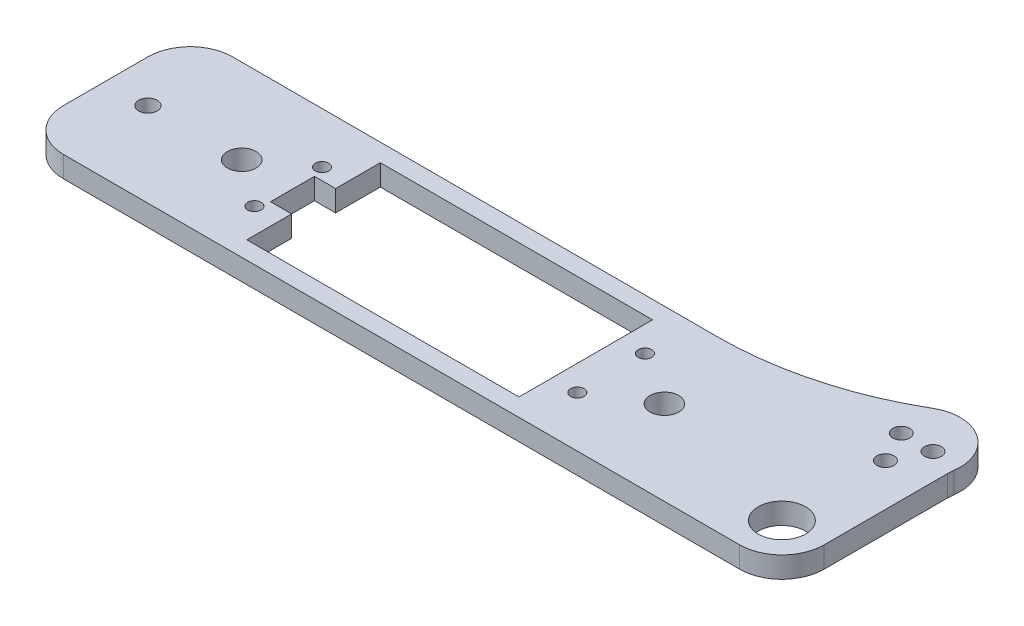
ISO-10303-21;
HEADER;
FILE_DESCRIPTION(('STEP AP214'),'2;1');
FILE_NAME('part.step','',(''),(''),'','','');
FILE_SCHEMA(('AUTOMOTIVE_DESIGN { 1 0 10303 214 1 1 1 1 }'));
ENDSEC;
DATA;
#1=APPLICATION_CONTEXT('core data for automotive mechanical design processes');
#2=APPLICATION_PROTOCOL_DEFINITION('international standard','automotive_design',2000,#1);
#3=PRODUCT_CONTEXT('',#1,'mechanical');
#4=PRODUCT('Part','Part','',(#3));
#5=PRODUCT_RELATED_PRODUCT_CATEGORY('part','',(#4));
#6=PRODUCT_DEFINITION_FORMATION('','',#4);
#7=PRODUCT_DEFINITION_CONTEXT('part definition',#1,'design');
#8=PRODUCT_DEFINITION('design','',#6,#7);
#9=PRODUCT_DEFINITION_SHAPE('','',#8);
#10=(LENGTH_UNIT() NAMED_UNIT(*) SI_UNIT(.MILLI.,.METRE.));
#11=(NAMED_UNIT(*) PLANE_ANGLE_UNIT() SI_UNIT($,.RADIAN.));
#12=(NAMED_UNIT(*) SI_UNIT($,.STERADIAN.) SOLID_ANGLE_UNIT());
#13=UNCERTAINTY_MEASURE_WITH_UNIT(LENGTH_MEASURE(1.E-05),#10,'distance_accuracy_value','');
#14=(GEOMETRIC_REPRESENTATION_CONTEXT(3) GLOBAL_UNCERTAINTY_ASSIGNED_CONTEXT((#13)) GLOBAL_UNIT_ASSIGNED_CONTEXT((#10,
#11,#12)) REPRESENTATION_CONTEXT('',''));
#15=CARTESIAN_POINT('',(0.,0.,0.));
#16=DIRECTION('',(0.,0.,1.));
#17=DIRECTION('',(1.,0.,0.));
#18=AXIS2_PLACEMENT_3D('',#15,#16,#17);
#19=CARTESIAN_POINT('',(63.5,0.,-12.1783566943338));
#20=DIRECTION('',(0.,-1.,0.));
#21=DIRECTION('',(0.,0.,-1.));
#22=AXIS2_PLACEMENT_3D('',#19,#20,#21);
#23=CYLINDRICAL_SURFACE('',#22,6.34999999999999);
#24=CARTESIAN_POINT('',(63.5,-3.175,-12.1783566943338));
#25=DIRECTION('',(0.,1.,0.));
#26=DIRECTION('',(0.,0.,1.));
#27=AXIS2_PLACEMENT_3D('',#24,#25,#26);
#28=CIRCLE('',#27,6.34999999999999);
#29=CARTESIAN_POINT('',(57.2122608868582,-3.175,-13.065394937628));
#30=VERTEX_POINT('',#29);
#31=CARTESIAN_POINT('',(57.15,-3.175,-12.1783566943338));
#32=VERTEX_POINT('',#31);
#33=EDGE_CURVE('E292',#30,#32,#28,.T.);
#34=ORIENTED_EDGE('',*,*,#33,.F.);
#35=DIRECTION('',(0.,-1.,0.));
#36=VECTOR('',#35,1.);
#37=CARTESIAN_POINT('',(57.2122608868582,0.,-13.065394937628));
#38=LINE('',#37,#36);
#39=CARTESIAN_POINT('',(57.2122608868582,0.,-13.065394937628));
#40=VERTEX_POINT('',#39);
#41=EDGE_CURVE('E11',#40,#30,#38,.T.);
#42=ORIENTED_EDGE('',*,*,#41,.F.);
#43=CARTESIAN_POINT('',(63.5,0.,-12.1783566943338));
#44=DIRECTION('',(0.,1.,0.));
#45=DIRECTION('',(0.,0.,1.));
#46=AXIS2_PLACEMENT_3D('',#43,#44,#45);
#47=CIRCLE('',#46,6.34999999999999);
#48=CARTESIAN_POINT('',(57.15,0.,-12.1783566943338));
#49=VERTEX_POINT('',#48);
#50=EDGE_CURVE('E295',#40,#49,#47,.T.);
#51=ORIENTED_EDGE('',*,*,#50,.T.);
#52=DIRECTION('',(0.,-1.,0.));
#53=VECTOR('',#52,1.);
#54=CARTESIAN_POINT('',(57.15,0.,-12.1783566943338));
#55=LINE('',#54,#53);
#56=EDGE_CURVE('E38',#49,#32,#55,.T.);
#57=ORIENTED_EDGE('',*,*,#56,.T.);
#58=EDGE_LOOP('',(#34,#42,#51,#57));
#59=FACE_BOUND('',#58,.T.);
#60=ADVANCED_FACE('F35',(#59),#23,.F.);
#61=CARTESIAN_POINT('',(50.8,0.,-13.97));
#62=DIRECTION('',(0.,-1.,0.));
#63=DIRECTION('',(0.,0.,-1.));
#64=AXIS2_PLACEMENT_3D('',#61,#62,#63);
#65=CYLINDRICAL_SURFACE('',#64,6.47575478226287);
#66=CARTESIAN_POINT('',(50.8,-3.175,-13.97));
#67=DIRECTION('',(0.,-1.,0.));
#68=DIRECTION('',(0.,0.,-1.));
#69=AXIS2_PLACEMENT_3D('',#66,#67,#68);
#70=CIRCLE('',#69,6.47575478226287);
#71=CARTESIAN_POINT('',(47.5480132116894,-3.175,-19.5699983864867));
#72=VERTEX_POINT('',#71);
#73=EDGE_CURVE('E299',#72,#30,#70,.T.);
#74=ORIENTED_EDGE('',*,*,#73,.F.);
#75=DIRECTION('',(0.,-1.,0.));
#76=VECTOR('',#75,1.);
#77=CARTESIAN_POINT('',(47.5480132116894,0.,-19.5699983864867));
#78=LINE('',#77,#76);
#79=CARTESIAN_POINT('',(47.5480132116894,0.,-19.5699983864867));
#80=VERTEX_POINT('',#79);
#81=EDGE_CURVE('E43',#80,#72,#78,.T.);
#82=ORIENTED_EDGE('',*,*,#81,.F.);
#83=CARTESIAN_POINT('',(50.8,0.,-13.97));
#84=DIRECTION('',(0.,-1.,0.));
#85=DIRECTION('',(0.,0.,-1.));
#86=AXIS2_PLACEMENT_3D('',#83,#84,#85);
#87=CIRCLE('',#86,6.47575478226287);
#88=EDGE_CURVE('E323',#80,#40,#87,.T.);
#89=ORIENTED_EDGE('',*,*,#88,.T.);
#90=ORIENTED_EDGE('',*,*,#41,.T.);
#91=EDGE_LOOP('',(#74,#82,#89,#90));
#92=FACE_BOUND('',#91,.T.);
#93=ADVANCED_FACE('F380',(#92),#65,.T.);
#94=CARTESIAN_POINT('',(22.037329993933,0.,-63.5));
#95=DIRECTION('',(0.,-1.,0.));
#96=DIRECTION('',(0.,0.,-1.));
#97=AXIS2_PLACEMENT_3D('',#94,#95,#96);
#98=CYLINDRICAL_SURFACE('',#97,50.8);
#99=CARTESIAN_POINT('',(22.037329993933,-3.175,-63.5));
#100=DIRECTION('',(0.,1.,0.));
#101=DIRECTION('',(0.,0.,1.));
#102=AXIS2_PLACEMENT_3D('',#99,#100,#101);
#103=CIRCLE('',#102,50.8);
#104=CARTESIAN_POINT('',(22.037329993933,-3.175,-12.7));
#105=VERTEX_POINT('',#104);
#106=EDGE_CURVE('E349',#105,#72,#103,.T.);
#107=ORIENTED_EDGE('',*,*,#106,.F.);
#108=DIRECTION('',(0.,-1.,0.));
#109=VECTOR('',#108,1.);
#110=CARTESIAN_POINT('',(22.037329993933,0.,-12.7));
#111=LINE('',#110,#109);
#112=CARTESIAN_POINT('',(22.037329993933,0.,-12.7));
#113=VERTEX_POINT('',#112);
#114=EDGE_CURVE('E355',#113,#105,#111,.T.);
#115=ORIENTED_EDGE('',*,*,#114,.F.);
#116=CARTESIAN_POINT('',(22.037329993933,0.,-63.5));
#117=DIRECTION('',(0.,1.,0.));
#118=DIRECTION('',(0.,0.,1.));
#119=AXIS2_PLACEMENT_3D('',#116,#117,#118);
#120=CIRCLE('',#119,50.8);
#121=EDGE_CURVE('E320',#113,#80,#120,.T.);
#122=ORIENTED_EDGE('',*,*,#121,.T.);
#123=ORIENTED_EDGE('',*,*,#81,.T.);
#124=EDGE_LOOP('',(#107,#115,#122,#123));
#125=FACE_BOUND('',#124,.T.);
#126=ADVANCED_FACE('F408',(#125),#98,.F.);
#127=CARTESIAN_POINT('',(-50.8,0.,-12.7));
#128=DIRECTION('',(0.,0.,-1.));
#129=DIRECTION('',(-1.,0.,0.));
#130=AXIS2_PLACEMENT_3D('',#127,#128,#129);
#131=PLANE('',#130);
#132=DIRECTION('',(1.,0.,0.));
#133=VECTOR('',#132,1.);
#134=CARTESIAN_POINT('',(-50.8,-3.175,-12.7));
#135=LINE('',#134,#133);
#136=CARTESIAN_POINT('',(-50.8,-3.175,-12.7));
#137=VERTEX_POINT('',#136);
#138=EDGE_CURVE('E346',#137,#105,#135,.T.);
#139=ORIENTED_EDGE('',*,*,#138,.F.);
#140=DIRECTION('',(0.,-1.,0.));
#141=VECTOR('',#140,1.);
#142=CARTESIAN_POINT('',(-50.8,0.,-12.7));
#143=LINE('',#142,#141);
#144=CARTESIAN_POINT('',(-50.8,0.,-12.7));
#145=VERTEX_POINT('',#144);
#146=EDGE_CURVE('E357',#145,#137,#143,.T.);
#147=ORIENTED_EDGE('',*,*,#146,.F.);
#148=DIRECTION('',(1.,0.,0.));
#149=VECTOR('',#148,1.);
#150=CARTESIAN_POINT('',(-50.8,0.,-12.7));
#151=LINE('',#150,#149);
#152=EDGE_CURVE('E317',#145,#113,#151,.T.);
#153=ORIENTED_EDGE('',*,*,#152,.T.);
#154=ORIENTED_EDGE('',*,*,#114,.T.);
#155=EDGE_LOOP('',(#139,#147,#153,#154));
#156=FACE_BOUND('',#155,.T.);
#157=ADVANCED_FACE('F406',(#156),#131,.T.);
#158=CARTESIAN_POINT('',(-50.8,0.,-6.35));
#159=DIRECTION('',(0.,-1.,0.));
#160=DIRECTION('',(0.,0.,-1.));
#161=AXIS2_PLACEMENT_3D('',#158,#159,#160);
#162=CYLINDRICAL_SURFACE('',#161,6.35);
#163=CARTESIAN_POINT('',(-50.8,-3.175,-6.35));
#164=DIRECTION('',(0.,-1.,0.));
#165=DIRECTION('',(0.,0.,-1.));
#166=AXIS2_PLACEMENT_3D('',#163,#164,#165);
#167=CIRCLE('',#166,6.35);
#168=CARTESIAN_POINT('',(-57.15,-3.175,-6.35));
#169=VERTEX_POINT('',#168);
#170=EDGE_CURVE('E343',#169,#137,#167,.T.);
#171=ORIENTED_EDGE('',*,*,#170,.F.);
#172=DIRECTION('',(0.,-1.,0.));
#173=VECTOR('',#172,1.);
#174=CARTESIAN_POINT('',(-57.15,0.,-6.35));
#175=LINE('',#174,#173);
#176=CARTESIAN_POINT('',(-57.15,0.,-6.35));
#177=VERTEX_POINT('',#176);
#178=EDGE_CURVE('E359',#177,#169,#175,.T.);
#179=ORIENTED_EDGE('',*,*,#178,.F.);
#180=CARTESIAN_POINT('',(-50.8,0.,-6.35));
#181=DIRECTION('',(0.,-1.,0.));
#182=DIRECTION('',(0.,0.,-1.));
#183=AXIS2_PLACEMENT_3D('',#180,#181,#182);
#184=CIRCLE('',#183,6.35);
#185=EDGE_CURVE('E314',#177,#145,#184,.T.);
#186=ORIENTED_EDGE('',*,*,#185,.T.);
#187=ORIENTED_EDGE('',*,*,#146,.T.);
#188=EDGE_LOOP('',(#171,#179,#186,#187));
#189=FACE_BOUND('',#188,.T.);
#190=ADVANCED_FACE('F402',(#189),#162,.T.);
#191=CARTESIAN_POINT('',(-57.15,0.,6.35));
#192=DIRECTION('',(-1.,0.,0.));
#193=DIRECTION('',(0.,0.,1.));
#194=AXIS2_PLACEMENT_3D('',#191,#192,#193);
#195=PLANE('',#194);
#196=DIRECTION('',(0.,0.,-1.));
#197=VECTOR('',#196,1.);
#198=CARTESIAN_POINT('',(-57.15,-3.175,6.35));
#199=LINE('',#198,#197);
#200=CARTESIAN_POINT('',(-57.15,-3.175,6.35));
#201=VERTEX_POINT('',#200);
#202=EDGE_CURVE('E340',#201,#169,#199,.T.);
#203=ORIENTED_EDGE('',*,*,#202,.F.);
#204=DIRECTION('',(0.,-1.,0.));
#205=VECTOR('',#204,1.);
#206=CARTESIAN_POINT('',(-57.15,0.,6.35));
#207=LINE('',#206,#205);
#208=CARTESIAN_POINT('',(-57.15,0.,6.35));
#209=VERTEX_POINT('',#208);
#210=EDGE_CURVE('E361',#209,#201,#207,.T.);
#211=ORIENTED_EDGE('',*,*,#210,.F.);
#212=DIRECTION('',(0.,0.,-1.));
#213=VECTOR('',#212,1.);
#214=CARTESIAN_POINT('',(-57.15,0.,6.35));
#215=LINE('',#214,#213);
#216=EDGE_CURVE('E311',#209,#177,#215,.T.);
#217=ORIENTED_EDGE('',*,*,#216,.T.);
#218=ORIENTED_EDGE('',*,*,#178,.T.);
#219=EDGE_LOOP('',(#203,#211,#217,#218));
#220=FACE_BOUND('',#219,.T.);
#221=ADVANCED_FACE('F398',(#220),#195,.T.);
#222=CARTESIAN_POINT('',(-50.8,0.,6.35));
#223=DIRECTION('',(0.,-1.,0.));
#224=DIRECTION('',(0.,0.,-1.));
#225=AXIS2_PLACEMENT_3D('',#222,#223,#224);
#226=CYLINDRICAL_SURFACE('',#225,6.35);
#227=CARTESIAN_POINT('',(-50.8,-3.175,6.35));
#228=DIRECTION('',(0.,-1.,0.));
#229=DIRECTION('',(0.,0.,-1.));
#230=AXIS2_PLACEMENT_3D('',#227,#228,#229);
#231=CIRCLE('',#230,6.35);
#232=CARTESIAN_POINT('',(-50.8,-3.175,12.7));
#233=VERTEX_POINT('',#232);
#234=EDGE_CURVE('E337',#233,#201,#231,.T.);
#235=ORIENTED_EDGE('',*,*,#234,.F.);
#236=DIRECTION('',(0.,-1.,0.));
#237=VECTOR('',#236,1.);
#238=CARTESIAN_POINT('',(-50.8,0.,12.7));
#239=LINE('',#238,#237);
#240=CARTESIAN_POINT('',(-50.8,0.,12.7));
#241=VERTEX_POINT('',#240);
#242=EDGE_CURVE('E363',#241,#233,#239,.T.);
#243=ORIENTED_EDGE('',*,*,#242,.F.);
#244=CARTESIAN_POINT('',(-50.8,0.,6.35));
#245=DIRECTION('',(0.,-1.,0.));
#246=DIRECTION('',(0.,0.,-1.));
#247=AXIS2_PLACEMENT_3D('',#244,#245,#246);
#248=CIRCLE('',#247,6.35);
#249=EDGE_CURVE('E308',#241,#209,#248,.T.);
#250=ORIENTED_EDGE('',*,*,#249,.T.);
#251=ORIENTED_EDGE('',*,*,#210,.T.);
#252=EDGE_LOOP('',(#235,#243,#250,#251));
#253=FACE_BOUND('',#252,.T.);
#254=ADVANCED_FACE('F394',(#253),#226,.T.);
#255=CARTESIAN_POINT('',(50.8,0.,12.7));
#256=DIRECTION('',(0.,0.,1.));
#257=DIRECTION('',(1.,0.,0.));
#258=AXIS2_PLACEMENT_3D('',#255,#256,#257);
#259=PLANE('',#258);
#260=DIRECTION('',(-1.,0.,0.));
#261=VECTOR('',#260,1.);
#262=CARTESIAN_POINT('',(50.8,-3.175,12.7));
#263=LINE('',#262,#261);
#264=CARTESIAN_POINT('',(50.8,-3.175,12.7));
#265=VERTEX_POINT('',#264);
#266=EDGE_CURVE('E334',#265,#233,#263,.T.);
#267=ORIENTED_EDGE('',*,*,#266,.F.);
#268=DIRECTION('',(0.,-1.,0.));
#269=VECTOR('',#268,1.);
#270=CARTESIAN_POINT('',(50.8,0.,12.7));
#271=LINE('',#270,#269);
#272=CARTESIAN_POINT('',(50.8,0.,12.7));
#273=VERTEX_POINT('',#272);
#274=EDGE_CURVE('E365',#273,#265,#271,.T.);
#275=ORIENTED_EDGE('',*,*,#274,.F.);
#276=DIRECTION('',(-1.,0.,0.));
#277=VECTOR('',#276,1.);
#278=CARTESIAN_POINT('',(50.8,0.,12.7));
#279=LINE('',#278,#277);
#280=EDGE_CURVE('E305',#273,#241,#279,.T.);
#281=ORIENTED_EDGE('',*,*,#280,.T.);
#282=ORIENTED_EDGE('',*,*,#242,.T.);
#283=EDGE_LOOP('',(#267,#275,#281,#282));
#284=FACE_BOUND('',#283,.T.);
#285=ADVANCED_FACE('F392',(#284),#259,.T.);
#286=CARTESIAN_POINT('',(50.8,0.,6.35));
#287=DIRECTION('',(0.,-1.,0.));
#288=DIRECTION('',(0.,0.,-1.));
#289=AXIS2_PLACEMENT_3D('',#286,#287,#288);
#290=CYLINDRICAL_SURFACE('',#289,6.35);
#291=CARTESIAN_POINT('',(50.8,-3.175,6.35));
#292=DIRECTION('',(0.,-1.,0.));
#293=DIRECTION('',(0.,0.,-1.));
#294=AXIS2_PLACEMENT_3D('',#291,#292,#293);
#295=CIRCLE('',#294,6.35);
#296=CARTESIAN_POINT('',(57.15,-3.175,6.35));
#297=VERTEX_POINT('',#296);
#298=EDGE_CURVE('E331',#297,#265,#295,.T.);
#299=ORIENTED_EDGE('',*,*,#298,.F.);
#300=DIRECTION('',(0.,-1.,0.));
#301=VECTOR('',#300,1.);
#302=CARTESIAN_POINT('',(57.15,0.,6.35));
#303=LINE('',#302,#301);
#304=CARTESIAN_POINT('',(57.15,0.,6.35));
#305=VERTEX_POINT('',#304);
#306=EDGE_CURVE('E366',#305,#297,#303,.T.);
#307=ORIENTED_EDGE('',*,*,#306,.F.);
#308=CARTESIAN_POINT('',(50.8,0.,6.35));
#309=DIRECTION('',(0.,-1.,0.));
#310=DIRECTION('',(0.,0.,-1.));
#311=AXIS2_PLACEMENT_3D('',#308,#309,#310);
#312=CIRCLE('',#311,6.35);
#313=EDGE_CURVE('E302',#305,#273,#312,.T.);
#314=ORIENTED_EDGE('',*,*,#313,.T.);
#315=ORIENTED_EDGE('',*,*,#274,.T.);
#316=EDGE_LOOP('',(#299,#307,#314,#315));
#317=FACE_BOUND('',#316,.T.);
#318=ADVANCED_FACE('F388',(#317),#290,.T.);
#319=CARTESIAN_POINT('',(57.15,0.,-12.1783566943338));
#320=DIRECTION('',(1.,0.,0.));
#321=DIRECTION('',(0.,0.,-1.));
#322=AXIS2_PLACEMENT_3D('',#319,#320,#321);
#323=PLANE('',#322);
#324=DIRECTION('',(0.,0.,1.));
#325=VECTOR('',#324,1.);
#326=CARTESIAN_POINT('',(57.15,-3.175,-12.1783566943338));
#327=LINE('',#326,#325);
#328=EDGE_CURVE('E328',#32,#297,#327,.T.);
#329=ORIENTED_EDGE('',*,*,#328,.F.);
#330=ORIENTED_EDGE('',*,*,#56,.F.);
#331=DIRECTION('',(0.,0.,1.));
#332=VECTOR('',#331,1.);
#333=CARTESIAN_POINT('',(57.15,0.,-12.1783566943338));
#334=LINE('',#333,#332);
#335=EDGE_CURVE('E298',#49,#305,#334,.T.);
#336=ORIENTED_EDGE('',*,*,#335,.T.);
#337=ORIENTED_EDGE('',*,*,#306,.T.);
#338=EDGE_LOOP('',(#329,#330,#336,#337));
#339=FACE_BOUND('',#338,.T.);
#340=ADVANCED_FACE('F374',(#339),#323,.T.);
#341=CARTESIAN_POINT('',(63.5,0.,-12.1783566943338));
#342=DIRECTION('',(0.,1.,0.));
#343=DIRECTION('',(0.,0.,1.));
#344=AXIS2_PLACEMENT_3D('',#341,#342,#343);
#345=PLANE('',#344);
#346=DIRECTION('',(0.,0.,-1.));
#347=VECTOR('',#346,1.);
#348=CARTESIAN_POINT('',(-25.908,0.,3.302));
#349=LINE('',#348,#347);
#350=CARTESIAN_POINT('',(-25.908,0.,10.033));
#351=VERTEX_POINT('',#350);
#352=CARTESIAN_POINT('',(-25.908,0.,3.302));
#353=VERTEX_POINT('',#352);
#354=EDGE_CURVE('E162',#351,#353,#349,.T.);
#355=ORIENTED_EDGE('',*,*,#354,.T.);
#356=DIRECTION('',(-1.,0.,0.));
#357=VECTOR('',#356,1.);
#358=CARTESIAN_POINT('',(-29.083,0.,3.302));
#359=LINE('',#358,#357);
#360=CARTESIAN_POINT('',(-29.083,0.,3.302));
#361=VERTEX_POINT('',#360);
#362=EDGE_CURVE('E171',#353,#361,#359,.T.);
#363=ORIENTED_EDGE('',*,*,#362,.T.);
#364=DIRECTION('',(0.,0.,-1.));
#365=VECTOR('',#364,1.);
#366=CARTESIAN_POINT('',(-29.083,0.,-3.302));
#367=LINE('',#366,#365);
#368=CARTESIAN_POINT('',(-29.083,0.,-3.302));
#369=VERTEX_POINT('',#368);
#370=EDGE_CURVE('E51',#361,#369,#367,.T.);
#371=ORIENTED_EDGE('',*,*,#370,.T.);
#372=DIRECTION('',(1.,0.,0.));
#373=VECTOR('',#372,1.);
#374=CARTESIAN_POINT('',(-25.908,0.,-3.302));
#375=LINE('',#374,#373);
#376=CARTESIAN_POINT('',(-25.908,0.,-3.302));
#377=VERTEX_POINT('',#376);
#378=EDGE_CURVE('E186',#369,#377,#375,.T.);
#379=ORIENTED_EDGE('',*,*,#378,.T.);
#380=DIRECTION('',(0.,0.,-1.));
#381=VECTOR('',#380,1.);
#382=CARTESIAN_POINT('',(-25.908,0.,-10.033));
#383=LINE('',#382,#381);
#384=CARTESIAN_POINT('',(-25.908,0.,-10.033));
#385=VERTEX_POINT('',#384);
#386=EDGE_CURVE('E189',#377,#385,#383,.T.);
#387=ORIENTED_EDGE('',*,*,#386,.T.);
#388=DIRECTION('',(1.,0.,0.));
#389=VECTOR('',#388,1.);
#390=CARTESIAN_POINT('',(14.986,0.,-10.033));
#391=LINE('',#390,#389);
#392=CARTESIAN_POINT('',(14.986,0.,-10.033));
#393=VERTEX_POINT('',#392);
#394=EDGE_CURVE('E192',#385,#393,#391,.T.);
#395=ORIENTED_EDGE('',*,*,#394,.T.);
#396=DIRECTION('',(0.,0.,1.));
#397=VECTOR('',#396,1.);
#398=CARTESIAN_POINT('',(14.986,0.,10.033));
#399=LINE('',#398,#397);
#400=CARTESIAN_POINT('',(14.986,0.,10.033));
#401=VERTEX_POINT('',#400);
#402=EDGE_CURVE('E195',#393,#401,#399,.T.);
#403=ORIENTED_EDGE('',*,*,#402,.T.);
#404=DIRECTION('',(-1.,0.,0.));
#405=VECTOR('',#404,1.);
#406=CARTESIAN_POINT('',(-25.908,0.,10.033));
#407=LINE('',#406,#405);
#408=EDGE_CURVE('E168',#401,#351,#407,.T.);
#409=ORIENTED_EDGE('',*,*,#408,.T.);
#410=EDGE_LOOP('',(#355,#363,#371,#379,#387,#395,#403,#409));
#411=FACE_BOUND('',#410,.T.);
#412=CARTESIAN_POINT('',(-50.8,0.,0.));
#413=DIRECTION('',(0.,-1.,0.));
#414=DIRECTION('',(0.,0.,1.));
#415=AXIS2_PLACEMENT_3D('',#412,#413,#414);
#416=CIRCLE('',#415,1.397);
#417=CARTESIAN_POINT('',(-50.8,0.,1.397));
#418=VERTEX_POINT('',#417);
#419=EDGE_CURVE('E229',#418,#418,#416,.T.);
#420=ORIENTED_EDGE('',*,*,#419,.T.);
#421=EDGE_LOOP('',(#420));
#422=FACE_BOUND('',#421,.T.);
#423=CARTESIAN_POINT('',(50.8,0.,6.35));
#424=DIRECTION('',(0.,-1.,0.));
#425=DIRECTION('',(0.,0.,1.));
#426=AXIS2_PLACEMENT_3D('',#423,#424,#425);
#427=CIRCLE('',#426,3.556);
#428=CARTESIAN_POINT('',(50.8,0.,9.906));
#429=VERTEX_POINT('',#428);
#430=EDGE_CURVE('E235',#429,#429,#427,.T.);
#431=ORIENTED_EDGE('',*,*,#430,.T.);
#432=EDGE_LOOP('',(#431));
#433=FACE_BOUND('',#432,.T.);
#434=CARTESIAN_POINT('',(53.18125,0.,-13.97));
#435=DIRECTION('',(0.,-1.,0.));
#436=DIRECTION('',(0.,0.,1.));
#437=AXIS2_PLACEMENT_3D('',#434,#435,#436);
#438=CIRCLE('',#437,1.27);
#439=CARTESIAN_POINT('',(53.18125,0.,-12.7));
#440=VERTEX_POINT('',#439);
#441=EDGE_CURVE('E241',#440,#440,#438,.T.);
#442=ORIENTED_EDGE('',*,*,#441,.T.);
#443=EDGE_LOOP('',(#442));
#444=FACE_BOUND('',#443,.T.);
#445=CARTESIAN_POINT('',(48.41875,0.,-13.97));
#446=DIRECTION('',(0.,-1.,0.));
#447=DIRECTION('',(0.,0.,1.));
#448=AXIS2_PLACEMENT_3D('',#445,#446,#447);
#449=CIRCLE('',#448,1.27);
#450=CARTESIAN_POINT('',(48.41875,0.,-12.7));
#451=VERTEX_POINT('',#450);
#452=EDGE_CURVE('E247',#451,#451,#449,.T.);
#453=ORIENTED_EDGE('',*,*,#452,.T.);
#454=EDGE_LOOP('',(#453));
#455=FACE_BOUND('',#454,.T.);
#456=CARTESIAN_POINT('',(50.8,0.,-9.2075));
#457=DIRECTION('',(0.,-1.,0.));
#458=DIRECTION('',(0.,0.,1.));
#459=AXIS2_PLACEMENT_3D('',#456,#457,#458);
#460=CIRCLE('',#459,1.27);
#461=CARTESIAN_POINT('',(50.8,0.,-7.9375));
#462=VERTEX_POINT('',#461);
#463=EDGE_CURVE('E253',#462,#462,#460,.T.);
#464=ORIENTED_EDGE('',*,*,#463,.T.);
#465=EDGE_LOOP('',(#464));
#466=FACE_BOUND('',#465,.T.);
#467=CARTESIAN_POINT('',(-29.718,0.,5.08));
#468=DIRECTION('',(0.,-1.,0.));
#469=DIRECTION('',(0.,0.,1.));
#470=AXIS2_PLACEMENT_3D('',#467,#468,#469);
#471=CIRCLE('',#470,1.016);
#472=CARTESIAN_POINT('',(-29.718,0.,6.096));
#473=VERTEX_POINT('',#472);
#474=EDGE_CURVE('E259',#473,#473,#471,.T.);
#475=ORIENTED_EDGE('',*,*,#474,.T.);
#476=EDGE_LOOP('',(#475));
#477=FACE_BOUND('',#476,.T.);
#478=CARTESIAN_POINT('',(18.796,0.,5.08));
#479=DIRECTION('',(0.,-1.,0.));
#480=DIRECTION('',(0.,0.,1.));
#481=AXIS2_PLACEMENT_3D('',#478,#479,#480);
#482=CIRCLE('',#481,1.016);
#483=CARTESIAN_POINT('',(18.796,0.,6.096));
#484=VERTEX_POINT('',#483);
#485=EDGE_CURVE('E265',#484,#484,#482,.T.);
#486=ORIENTED_EDGE('',*,*,#485,.T.);
#487=EDGE_LOOP('',(#486));
#488=FACE_BOUND('',#487,.T.);
#489=CARTESIAN_POINT('',(18.796,0.,-5.08));
#490=DIRECTION('',(0.,-1.,0.));
#491=DIRECTION('',(0.,0.,1.));
#492=AXIS2_PLACEMENT_3D('',#489,#490,#491);
#493=CIRCLE('',#492,1.016);
#494=CARTESIAN_POINT('',(18.796,0.,-4.064));
#495=VERTEX_POINT('',#494);
#496=EDGE_CURVE('E271',#495,#495,#493,.T.);
#497=ORIENTED_EDGE('',*,*,#496,.T.);
#498=EDGE_LOOP('',(#497));
#499=FACE_BOUND('',#498,.T.);
#500=CARTESIAN_POINT('',(-29.718,0.,-5.08));
#501=DIRECTION('',(0.,-1.,0.));
#502=DIRECTION('',(0.,0.,1.));
#503=AXIS2_PLACEMENT_3D('',#500,#501,#502);
#504=CIRCLE('',#503,1.016);
#505=CARTESIAN_POINT('',(-29.718,0.,-4.064));
#506=VERTEX_POINT('',#505);
#507=EDGE_CURVE('E277',#506,#506,#504,.T.);
#508=ORIENTED_EDGE('',*,*,#507,.T.);
#509=EDGE_LOOP('',(#508));
#510=FACE_BOUND('',#509,.T.);
#511=CARTESIAN_POINT('',(-36.703,0.,0.));
#512=DIRECTION('',(0.,-1.,0.));
#513=DIRECTION('',(0.,0.,1.));
#514=AXIS2_PLACEMENT_3D('',#511,#512,#513);
#515=CIRCLE('',#514,2.159);
#516=CARTESIAN_POINT('',(-36.703,0.,2.159));
#517=VERTEX_POINT('',#516);
#518=EDGE_CURVE('E283',#517,#517,#515,.T.);
#519=ORIENTED_EDGE('',*,*,#518,.T.);
#520=EDGE_LOOP('',(#519));
#521=FACE_BOUND('',#520,.T.);
#522=CARTESIAN_POINT('',(26.797,0.,0.));
#523=DIRECTION('',(0.,-1.,0.));
#524=DIRECTION('',(0.,0.,1.));
#525=AXIS2_PLACEMENT_3D('',#522,#523,#524);
#526=CIRCLE('',#525,2.159);
#527=CARTESIAN_POINT('',(26.797,0.,2.159));
#528=VERTEX_POINT('',#527);
#529=EDGE_CURVE('E289',#528,#528,#526,.T.);
#530=ORIENTED_EDGE('',*,*,#529,.T.);
#531=EDGE_LOOP('',(#530));
#532=FACE_BOUND('',#531,.T.);
#533=ORIENTED_EDGE('',*,*,#50,.F.);
#534=ORIENTED_EDGE('',*,*,#88,.F.);
#535=ORIENTED_EDGE('',*,*,#121,.F.);
#536=ORIENTED_EDGE('',*,*,#152,.F.);
#537=ORIENTED_EDGE('',*,*,#185,.F.);
#538=ORIENTED_EDGE('',*,*,#216,.F.);
#539=ORIENTED_EDGE('',*,*,#249,.F.);
#540=ORIENTED_EDGE('',*,*,#280,.F.);
#541=ORIENTED_EDGE('',*,*,#313,.F.);
#542=ORIENTED_EDGE('',*,*,#335,.F.);
#543=EDGE_LOOP('',(#533,#534,#535,#536,#537,#538,#539,#540,#541,#542));
#544=FACE_BOUND('',#543,.T.);
#545=ADVANCED_FACE('F175',(#411,#422,#433,#444,#455,#466,#477,#488,#499,#510,#521,#532,#544),
#345,.T.);
#546=CARTESIAN_POINT('',(63.5,-3.175,-12.1783566943338));
#547=DIRECTION('',(0.,1.,0.));
#548=DIRECTION('',(0.,0.,1.));
#549=AXIS2_PLACEMENT_3D('',#546,#547,#548);
#550=PLANE('',#549);
#551=DIRECTION('',(-1.,0.,0.));
#552=VECTOR('',#551,1.);
#553=CARTESIAN_POINT('',(-29.083,-3.175,3.302));
#554=LINE('',#553,#552);
#555=CARTESIAN_POINT('',(-25.908,-3.175,3.302));
#556=VERTEX_POINT('',#555);
#557=CARTESIAN_POINT('',(-29.083,-3.175,3.302));
#558=VERTEX_POINT('',#557);
#559=EDGE_CURVE('E199',#556,#558,#554,.T.);
#560=ORIENTED_EDGE('',*,*,#559,.F.);
#561=DIRECTION('',(0.,0.,-1.));
#562=VECTOR('',#561,1.);
#563=CARTESIAN_POINT('',(-25.908,-3.175,3.302));
#564=LINE('',#563,#562);
#565=CARTESIAN_POINT('',(-25.908,-3.175,10.033));
#566=VERTEX_POINT('',#565);
#567=EDGE_CURVE('E59',#566,#556,#564,.T.);
#568=ORIENTED_EDGE('',*,*,#567,.F.);
#569=DIRECTION('',(-1.,0.,0.));
#570=VECTOR('',#569,1.);
#571=CARTESIAN_POINT('',(-25.908,-3.175,10.033));
#572=LINE('',#571,#570);
#573=CARTESIAN_POINT('',(14.986,-3.175,10.033));
#574=VERTEX_POINT('',#573);
#575=EDGE_CURVE('E179',#574,#566,#572,.T.);
#576=ORIENTED_EDGE('',*,*,#575,.F.);
#577=DIRECTION('',(0.,0.,1.));
#578=VECTOR('',#577,1.);
#579=CARTESIAN_POINT('',(14.986,-3.175,10.033));
#580=LINE('',#579,#578);
#581=CARTESIAN_POINT('',(14.986,-3.175,-10.033));
#582=VERTEX_POINT('',#581);
#583=EDGE_CURVE('E182',#582,#574,#580,.T.);
#584=ORIENTED_EDGE('',*,*,#583,.F.);
#585=DIRECTION('',(1.,0.,0.));
#586=VECTOR('',#585,1.);
#587=CARTESIAN_POINT('',(14.986,-3.175,-10.033));
#588=LINE('',#587,#586);
#589=CARTESIAN_POINT('',(-25.908,-3.175,-10.033));
#590=VERTEX_POINT('',#589);
#591=EDGE_CURVE('E210',#590,#582,#588,.T.);
#592=ORIENTED_EDGE('',*,*,#591,.F.);
#593=DIRECTION('',(0.,0.,-1.));
#594=VECTOR('',#593,1.);
#595=CARTESIAN_POINT('',(-25.908,-3.175,-10.033));
#596=LINE('',#595,#594);
#597=CARTESIAN_POINT('',(-25.908,-3.175,-3.302));
#598=VERTEX_POINT('',#597);
#599=EDGE_CURVE('E207',#598,#590,#596,.T.);
#600=ORIENTED_EDGE('',*,*,#599,.F.);
#601=DIRECTION('',(1.,0.,0.));
#602=VECTOR('',#601,1.);
#603=CARTESIAN_POINT('',(-25.908,-3.175,-3.302));
#604=LINE('',#603,#602);
#605=CARTESIAN_POINT('',(-29.083,-3.175,-3.302));
#606=VERTEX_POINT('',#605);
#607=EDGE_CURVE('E204',#606,#598,#604,.T.);
#608=ORIENTED_EDGE('',*,*,#607,.F.);
#609=DIRECTION('',(0.,0.,-1.));
#610=VECTOR('',#609,1.);
#611=CARTESIAN_POINT('',(-29.083,-3.175,-3.302));
#612=LINE('',#611,#610);
#613=EDGE_CURVE('E201',#558,#606,#612,.T.);
#614=ORIENTED_EDGE('',*,*,#613,.F.);
#615=EDGE_LOOP('',(#560,#568,#576,#584,#592,#600,#608,#614));
#616=FACE_BOUND('',#615,.T.);
#617=CARTESIAN_POINT('',(-50.8,-3.175,0.));
#618=DIRECTION('',(0.,-1.,0.));
#619=DIRECTION('',(0.,0.,1.));
#620=AXIS2_PLACEMENT_3D('',#617,#618,#619);
#621=CIRCLE('',#620,1.397);
#622=CARTESIAN_POINT('',(-50.8,-3.175,1.397));
#623=VERTEX_POINT('',#622);
#624=EDGE_CURVE('E217',#623,#623,#621,.T.);
#625=ORIENTED_EDGE('',*,*,#624,.F.);
#626=EDGE_LOOP('',(#625));
#627=FACE_BOUND('',#626,.T.);
#628=CARTESIAN_POINT('',(50.8,-3.175,6.35));
#629=DIRECTION('',(0.,-1.,0.));
#630=DIRECTION('',(0.,0.,1.));
#631=AXIS2_PLACEMENT_3D('',#628,#629,#630);
#632=CIRCLE('',#631,3.556);
#633=CARTESIAN_POINT('',(50.8,-3.175,9.906));
#634=VERTEX_POINT('',#633);
#635=EDGE_CURVE('E232',#634,#634,#632,.T.);
#636=ORIENTED_EDGE('',*,*,#635,.F.);
#637=EDGE_LOOP('',(#636));
#638=FACE_BOUND('',#637,.T.);
#639=CARTESIAN_POINT('',(53.18125,-3.175,-13.97));
#640=DIRECTION('',(0.,-1.,0.));
#641=DIRECTION('',(0.,0.,1.));
#642=AXIS2_PLACEMENT_3D('',#639,#640,#641);
#643=CIRCLE('',#642,1.27);
#644=CARTESIAN_POINT('',(53.18125,-3.175,-12.7));
#645=VERTEX_POINT('',#644);
#646=EDGE_CURVE('E238',#645,#645,#643,.T.);
#647=ORIENTED_EDGE('',*,*,#646,.F.);
#648=EDGE_LOOP('',(#647));
#649=FACE_BOUND('',#648,.T.);
#650=CARTESIAN_POINT('',(48.41875,-3.175,-13.97));
#651=DIRECTION('',(0.,-1.,0.));
#652=DIRECTION('',(0.,0.,1.));
#653=AXIS2_PLACEMENT_3D('',#650,#651,#652);
#654=CIRCLE('',#653,1.27);
#655=CARTESIAN_POINT('',(48.41875,-3.175,-12.7));
#656=VERTEX_POINT('',#655);
#657=EDGE_CURVE('E244',#656,#656,#654,.T.);
#658=ORIENTED_EDGE('',*,*,#657,.F.);
#659=EDGE_LOOP('',(#658));
#660=FACE_BOUND('',#659,.T.);
#661=CARTESIAN_POINT('',(50.8,-3.175,-9.2075));
#662=DIRECTION('',(0.,-1.,0.));
#663=DIRECTION('',(0.,0.,1.));
#664=AXIS2_PLACEMENT_3D('',#661,#662,#663);
#665=CIRCLE('',#664,1.27);
#666=CARTESIAN_POINT('',(50.8,-3.175,-7.9375));
#667=VERTEX_POINT('',#666);
#668=EDGE_CURVE('E250',#667,#667,#665,.T.);
#669=ORIENTED_EDGE('',*,*,#668,.F.);
#670=EDGE_LOOP('',(#669));
#671=FACE_BOUND('',#670,.T.);
#672=CARTESIAN_POINT('',(-29.718,-3.175,5.08));
#673=DIRECTION('',(0.,-1.,0.));
#674=DIRECTION('',(0.,0.,1.));
#675=AXIS2_PLACEMENT_3D('',#672,#673,#674);
#676=CIRCLE('',#675,1.016);
#677=CARTESIAN_POINT('',(-29.718,-3.175,6.096));
#678=VERTEX_POINT('',#677);
#679=EDGE_CURVE('E256',#678,#678,#676,.T.);
#680=ORIENTED_EDGE('',*,*,#679,.F.);
#681=EDGE_LOOP('',(#680));
#682=FACE_BOUND('',#681,.T.);
#683=CARTESIAN_POINT('',(18.796,-3.175,5.08));
#684=DIRECTION('',(0.,-1.,0.));
#685=DIRECTION('',(0.,0.,1.));
#686=AXIS2_PLACEMENT_3D('',#683,#684,#685);
#687=CIRCLE('',#686,1.016);
#688=CARTESIAN_POINT('',(18.796,-3.175,6.096));
#689=VERTEX_POINT('',#688);
#690=EDGE_CURVE('E262',#689,#689,#687,.T.);
#691=ORIENTED_EDGE('',*,*,#690,.F.);
#692=EDGE_LOOP('',(#691));
#693=FACE_BOUND('',#692,.T.);
#694=CARTESIAN_POINT('',(18.796,-3.175,-5.08));
#695=DIRECTION('',(0.,-1.,0.));
#696=DIRECTION('',(0.,0.,1.));
#697=AXIS2_PLACEMENT_3D('',#694,#695,#696);
#698=CIRCLE('',#697,1.016);
#699=CARTESIAN_POINT('',(18.796,-3.175,-4.064));
#700=VERTEX_POINT('',#699);
#701=EDGE_CURVE('E268',#700,#700,#698,.T.);
#702=ORIENTED_EDGE('',*,*,#701,.F.);
#703=EDGE_LOOP('',(#702));
#704=FACE_BOUND('',#703,.T.);
#705=CARTESIAN_POINT('',(-29.718,-3.175,-5.08));
#706=DIRECTION('',(0.,-1.,0.));
#707=DIRECTION('',(0.,0.,1.));
#708=AXIS2_PLACEMENT_3D('',#705,#706,#707);
#709=CIRCLE('',#708,1.016);
#710=CARTESIAN_POINT('',(-29.718,-3.175,-4.064));
#711=VERTEX_POINT('',#710);
#712=EDGE_CURVE('E274',#711,#711,#709,.T.);
#713=ORIENTED_EDGE('',*,*,#712,.F.);
#714=EDGE_LOOP('',(#713));
#715=FACE_BOUND('',#714,.T.);
#716=CARTESIAN_POINT('',(-36.703,-3.175,0.));
#717=DIRECTION('',(0.,-1.,0.));
#718=DIRECTION('',(0.,0.,1.));
#719=AXIS2_PLACEMENT_3D('',#716,#717,#718);
#720=CIRCLE('',#719,2.159);
#721=CARTESIAN_POINT('',(-36.703,-3.175,2.159));
#722=VERTEX_POINT('',#721);
#723=EDGE_CURVE('E280',#722,#722,#720,.T.);
#724=ORIENTED_EDGE('',*,*,#723,.F.);
#725=EDGE_LOOP('',(#724));
#726=FACE_BOUND('',#725,.T.);
#727=CARTESIAN_POINT('',(26.797,-3.175,0.));
#728=DIRECTION('',(0.,-1.,0.));
#729=DIRECTION('',(0.,0.,1.));
#730=AXIS2_PLACEMENT_3D('',#727,#728,#729);
#731=CIRCLE('',#730,2.159);
#732=CARTESIAN_POINT('',(26.797,-3.175,2.159));
#733=VERTEX_POINT('',#732);
#734=EDGE_CURVE('E286',#733,#733,#731,.T.);
#735=ORIENTED_EDGE('',*,*,#734,.F.);
#736=EDGE_LOOP('',(#735));
#737=FACE_BOUND('',#736,.T.);
#738=ORIENTED_EDGE('',*,*,#33,.T.);
#739=ORIENTED_EDGE('',*,*,#328,.T.);
#740=ORIENTED_EDGE('',*,*,#298,.T.);
#741=ORIENTED_EDGE('',*,*,#266,.T.);
#742=ORIENTED_EDGE('',*,*,#234,.T.);
#743=ORIENTED_EDGE('',*,*,#202,.T.);
#744=ORIENTED_EDGE('',*,*,#170,.T.);
#745=ORIENTED_EDGE('',*,*,#138,.T.);
#746=ORIENTED_EDGE('',*,*,#106,.T.);
#747=ORIENTED_EDGE('',*,*,#73,.T.);
#748=EDGE_LOOP('',(#738,#739,#740,#741,#742,#743,#744,#745,#746,#747));
#749=FACE_BOUND('',#748,.T.);
#750=ADVANCED_FACE('F376',(#616,#627,#638,#649,#660,#671,#682,#693,#704,#715,#726,#737,#749),
#550,.F.);
#751=CARTESIAN_POINT('',(26.797,0.,0.));
#752=DIRECTION('',(0.,-1.,0.));
#753=DIRECTION('',(0.,0.,-1.));
#754=AXIS2_PLACEMENT_3D('',#751,#752,#753);
#755=CYLINDRICAL_SURFACE('',#754,2.159);
#756=ORIENTED_EDGE('',*,*,#529,.F.);
#757=EDGE_LOOP('',(#756));
#758=FACE_BOUND('',#757,.T.);
#759=ORIENTED_EDGE('',*,*,#734,.T.);
#760=EDGE_LOOP('',(#759));
#761=FACE_BOUND('',#760,.T.);
#762=ADVANCED_FACE('F498',(#758,#761),#755,.F.);
#763=CARTESIAN_POINT('',(-36.703,0.,0.));
#764=DIRECTION('',(0.,-1.,0.));
#765=DIRECTION('',(0.,0.,-1.));
#766=AXIS2_PLACEMENT_3D('',#763,#764,#765);
#767=CYLINDRICAL_SURFACE('',#766,2.159);
#768=ORIENTED_EDGE('',*,*,#518,.F.);
#769=EDGE_LOOP('',(#768));
#770=FACE_BOUND('',#769,.T.);
#771=ORIENTED_EDGE('',*,*,#723,.T.);
#772=EDGE_LOOP('',(#771));
#773=FACE_BOUND('',#772,.T.);
#774=ADVANCED_FACE('F508',(#770,#773),#767,.F.);
#775=CARTESIAN_POINT('',(-29.718,0.,-5.08));
#776=DIRECTION('',(0.,-1.,0.));
#777=DIRECTION('',(0.,0.,-1.));
#778=AXIS2_PLACEMENT_3D('',#775,#776,#777);
#779=CYLINDRICAL_SURFACE('',#778,1.016);
#780=ORIENTED_EDGE('',*,*,#507,.F.);
#781=EDGE_LOOP('',(#780));
#782=FACE_BOUND('',#781,.T.);
#783=ORIENTED_EDGE('',*,*,#712,.T.);
#784=EDGE_LOOP('',(#783));
#785=FACE_BOUND('',#784,.T.);
#786=ADVANCED_FACE('F518',(#782,#785),#779,.F.);
#787=CARTESIAN_POINT('',(18.796,0.,-5.08));
#788=DIRECTION('',(0.,-1.,0.));
#789=DIRECTION('',(0.,0.,-1.));
#790=AXIS2_PLACEMENT_3D('',#787,#788,#789);
#791=CYLINDRICAL_SURFACE('',#790,1.016);
#792=ORIENTED_EDGE('',*,*,#496,.F.);
#793=EDGE_LOOP('',(#792));
#794=FACE_BOUND('',#793,.T.);
#795=ORIENTED_EDGE('',*,*,#701,.T.);
#796=EDGE_LOOP('',(#795));
#797=FACE_BOUND('',#796,.T.);
#798=ADVANCED_FACE('F528',(#794,#797),#791,.F.);
#799=CARTESIAN_POINT('',(18.796,0.,5.08));
#800=DIRECTION('',(0.,-1.,0.));
#801=DIRECTION('',(0.,0.,-1.));
#802=AXIS2_PLACEMENT_3D('',#799,#800,#801);
#803=CYLINDRICAL_SURFACE('',#802,1.016);
#804=ORIENTED_EDGE('',*,*,#485,.F.);
#805=EDGE_LOOP('',(#804));
#806=FACE_BOUND('',#805,.T.);
#807=ORIENTED_EDGE('',*,*,#690,.T.);
#808=EDGE_LOOP('',(#807));
#809=FACE_BOUND('',#808,.T.);
#810=ADVANCED_FACE('F538',(#806,#809),#803,.F.);
#811=CARTESIAN_POINT('',(-29.718,0.,5.08));
#812=DIRECTION('',(0.,-1.,0.));
#813=DIRECTION('',(0.,0.,-1.));
#814=AXIS2_PLACEMENT_3D('',#811,#812,#813);
#815=CYLINDRICAL_SURFACE('',#814,1.016);
#816=ORIENTED_EDGE('',*,*,#474,.F.);
#817=EDGE_LOOP('',(#816));
#818=FACE_BOUND('',#817,.T.);
#819=ORIENTED_EDGE('',*,*,#679,.T.);
#820=EDGE_LOOP('',(#819));
#821=FACE_BOUND('',#820,.T.);
#822=ADVANCED_FACE('F548',(#818,#821),#815,.F.);
#823=CARTESIAN_POINT('',(50.8,0.,-9.2075));
#824=DIRECTION('',(0.,-1.,0.));
#825=DIRECTION('',(0.,0.,-1.));
#826=AXIS2_PLACEMENT_3D('',#823,#824,#825);
#827=CYLINDRICAL_SURFACE('',#826,1.27);
#828=ORIENTED_EDGE('',*,*,#463,.F.);
#829=EDGE_LOOP('',(#828));
#830=FACE_BOUND('',#829,.T.);
#831=ORIENTED_EDGE('',*,*,#668,.T.);
#832=EDGE_LOOP('',(#831));
#833=FACE_BOUND('',#832,.T.);
#834=ADVANCED_FACE('F558',(#830,#833),#827,.F.);
#835=CARTESIAN_POINT('',(48.41875,0.,-13.97));
#836=DIRECTION('',(0.,-1.,0.));
#837=DIRECTION('',(0.,0.,-1.));
#838=AXIS2_PLACEMENT_3D('',#835,#836,#837);
#839=CYLINDRICAL_SURFACE('',#838,1.27);
#840=ORIENTED_EDGE('',*,*,#452,.F.);
#841=EDGE_LOOP('',(#840));
#842=FACE_BOUND('',#841,.T.);
#843=ORIENTED_EDGE('',*,*,#657,.T.);
#844=EDGE_LOOP('',(#843));
#845=FACE_BOUND('',#844,.T.);
#846=ADVANCED_FACE('F568',(#842,#845),#839,.F.);
#847=CARTESIAN_POINT('',(53.18125,0.,-13.97));
#848=DIRECTION('',(0.,-1.,0.));
#849=DIRECTION('',(0.,0.,-1.));
#850=AXIS2_PLACEMENT_3D('',#847,#848,#849);
#851=CYLINDRICAL_SURFACE('',#850,1.27);
#852=ORIENTED_EDGE('',*,*,#441,.F.);
#853=EDGE_LOOP('',(#852));
#854=FACE_BOUND('',#853,.T.);
#855=ORIENTED_EDGE('',*,*,#646,.T.);
#856=EDGE_LOOP('',(#855));
#857=FACE_BOUND('',#856,.T.);
#858=ADVANCED_FACE('F578',(#854,#857),#851,.F.);
#859=CARTESIAN_POINT('',(50.8,0.,6.35));
#860=DIRECTION('',(0.,-1.,0.));
#861=DIRECTION('',(0.,0.,-1.));
#862=AXIS2_PLACEMENT_3D('',#859,#860,#861);
#863=CYLINDRICAL_SURFACE('',#862,3.556);
#864=ORIENTED_EDGE('',*,*,#430,.F.);
#865=EDGE_LOOP('',(#864));
#866=FACE_BOUND('',#865,.T.);
#867=ORIENTED_EDGE('',*,*,#635,.T.);
#868=EDGE_LOOP('',(#867));
#869=FACE_BOUND('',#868,.T.);
#870=ADVANCED_FACE('F588',(#866,#869),#863,.F.);
#871=CARTESIAN_POINT('',(-50.8,0.,0.));
#872=DIRECTION('',(0.,-1.,0.));
#873=DIRECTION('',(0.,0.,-1.));
#874=AXIS2_PLACEMENT_3D('',#871,#872,#873);
#875=CYLINDRICAL_SURFACE('',#874,1.397);
#876=ORIENTED_EDGE('',*,*,#419,.F.);
#877=EDGE_LOOP('',(#876));
#878=FACE_BOUND('',#877,.T.);
#879=ORIENTED_EDGE('',*,*,#624,.T.);
#880=EDGE_LOOP('',(#879));
#881=FACE_BOUND('',#880,.T.);
#882=ADVANCED_FACE('F598',(#878,#881),#875,.F.);
#883=CARTESIAN_POINT('',(-25.908,0.,3.302));
#884=DIRECTION('',(-1.,0.,0.));
#885=DIRECTION('',(0.,0.,1.));
#886=AXIS2_PLACEMENT_3D('',#883,#884,#885);
#887=PLANE('',#886);
#888=ORIENTED_EDGE('',*,*,#567,.T.);
#889=DIRECTION('',(0.,-1.,0.));
#890=VECTOR('',#889,1.);
#891=CARTESIAN_POINT('',(-25.908,0.,3.302));
#892=LINE('',#891,#890);
#893=EDGE_CURVE('E158',#353,#556,#892,.T.);
#894=ORIENTED_EDGE('',*,*,#893,.F.);
#895=ORIENTED_EDGE('',*,*,#354,.F.);
#896=DIRECTION('',(0.,-1.,0.));
#897=VECTOR('',#896,1.);
#898=CARTESIAN_POINT('',(-25.908,0.,10.033));
#899=LINE('',#898,#897);
#900=EDGE_CURVE('E215',#351,#566,#899,.T.);
#901=ORIENTED_EDGE('',*,*,#900,.T.);
#902=EDGE_LOOP('',(#888,#894,#895,#901));
#903=FACE_BOUND('',#902,.T.);
#904=ADVANCED_FACE('F160',(#903),#887,.F.);
#905=CARTESIAN_POINT('',(-25.908,0.,10.033));
#906=DIRECTION('',(0.,0.,1.));
#907=DIRECTION('',(1.,0.,0.));
#908=AXIS2_PLACEMENT_3D('',#905,#906,#907);
#909=PLANE('',#908);
#910=ORIENTED_EDGE('',*,*,#575,.T.);
#911=ORIENTED_EDGE('',*,*,#900,.F.);
#912=ORIENTED_EDGE('',*,*,#408,.F.);
#913=DIRECTION('',(0.,-1.,0.));
#914=VECTOR('',#913,1.);
#915=CARTESIAN_POINT('',(14.986,0.,10.033));
#916=LINE('',#915,#914);
#917=EDGE_CURVE('E218',#401,#574,#916,.T.);
#918=ORIENTED_EDGE('',*,*,#917,.T.);
#919=EDGE_LOOP('',(#910,#911,#912,#918));
#920=FACE_BOUND('',#919,.T.);
#921=ADVANCED_FACE('F617',(#920),#909,.F.);
#922=CARTESIAN_POINT('',(14.986,0.,10.033));
#923=DIRECTION('',(1.,0.,0.));
#924=DIRECTION('',(0.,0.,-1.));
#925=AXIS2_PLACEMENT_3D('',#922,#923,#924);
#926=PLANE('',#925);
#927=ORIENTED_EDGE('',*,*,#583,.T.);
#928=ORIENTED_EDGE('',*,*,#917,.F.);
#929=ORIENTED_EDGE('',*,*,#402,.F.);
#930=DIRECTION('',(0.,-1.,0.));
#931=VECTOR('',#930,1.);
#932=CARTESIAN_POINT('',(14.986,0.,-10.033));
#933=LINE('',#932,#931);
#934=EDGE_CURVE('E220',#393,#582,#933,.T.);
#935=ORIENTED_EDGE('',*,*,#934,.T.);
#936=EDGE_LOOP('',(#927,#928,#929,#935));
#937=FACE_BOUND('',#936,.T.);
#938=ADVANCED_FACE('F626',(#937),#926,.F.);
#939=CARTESIAN_POINT('',(14.986,0.,-10.033));
#940=DIRECTION('',(0.,0.,-1.));
#941=DIRECTION('',(-1.,0.,0.));
#942=AXIS2_PLACEMENT_3D('',#939,#940,#941);
#943=PLANE('',#942);
#944=ORIENTED_EDGE('',*,*,#591,.T.);
#945=ORIENTED_EDGE('',*,*,#934,.F.);
#946=ORIENTED_EDGE('',*,*,#394,.F.);
#947=DIRECTION('',(0.,-1.,0.));
#948=VECTOR('',#947,1.);
#949=CARTESIAN_POINT('',(-25.908,0.,-10.033));
#950=LINE('',#949,#948);
#951=EDGE_CURVE('E222',#385,#590,#950,.T.);
#952=ORIENTED_EDGE('',*,*,#951,.T.);
#953=EDGE_LOOP('',(#944,#945,#946,#952));
#954=FACE_BOUND('',#953,.T.);
#955=ADVANCED_FACE('F636',(#954),#943,.F.);
#956=CARTESIAN_POINT('',(-25.908,0.,-10.033));
#957=DIRECTION('',(-1.,0.,0.));
#958=DIRECTION('',(0.,0.,1.));
#959=AXIS2_PLACEMENT_3D('',#956,#957,#958);
#960=PLANE('',#959);
#961=ORIENTED_EDGE('',*,*,#599,.T.);
#962=ORIENTED_EDGE('',*,*,#951,.F.);
#963=ORIENTED_EDGE('',*,*,#386,.F.);
#964=DIRECTION('',(0.,-1.,0.));
#965=VECTOR('',#964,1.);
#966=CARTESIAN_POINT('',(-25.908,0.,-3.302));
#967=LINE('',#966,#965);
#968=EDGE_CURVE('E224',#377,#598,#967,.T.);
#969=ORIENTED_EDGE('',*,*,#968,.T.);
#970=EDGE_LOOP('',(#961,#962,#963,#969));
#971=FACE_BOUND('',#970,.T.);
#972=ADVANCED_FACE('F646',(#971),#960,.F.);
#973=CARTESIAN_POINT('',(-25.908,0.,-3.302));
#974=DIRECTION('',(0.,0.,-1.));
#975=DIRECTION('',(-1.,0.,0.));
#976=AXIS2_PLACEMENT_3D('',#973,#974,#975);
#977=PLANE('',#976);
#978=ORIENTED_EDGE('',*,*,#607,.T.);
#979=ORIENTED_EDGE('',*,*,#968,.F.);
#980=ORIENTED_EDGE('',*,*,#378,.F.);
#981=DIRECTION('',(0.,-1.,0.));
#982=VECTOR('',#981,1.);
#983=CARTESIAN_POINT('',(-29.083,0.,-3.302));
#984=LINE('',#983,#982);
#985=EDGE_CURVE('E226',#369,#606,#984,.T.);
#986=ORIENTED_EDGE('',*,*,#985,.T.);
#987=EDGE_LOOP('',(#978,#979,#980,#986));
#988=FACE_BOUND('',#987,.T.);
#989=ADVANCED_FACE('F656',(#988),#977,.F.);
#990=CARTESIAN_POINT('',(-29.083,0.,-3.302));
#991=DIRECTION('',(-1.,0.,0.));
#992=DIRECTION('',(0.,0.,1.));
#993=AXIS2_PLACEMENT_3D('',#990,#991,#992);
#994=PLANE('',#993);
#995=ORIENTED_EDGE('',*,*,#613,.T.);
#996=ORIENTED_EDGE('',*,*,#985,.F.);
#997=ORIENTED_EDGE('',*,*,#370,.F.);
#998=DIRECTION('',(0.,-1.,0.));
#999=VECTOR('',#998,1.);
#1000=CARTESIAN_POINT('',(-29.083,0.,3.302));
#1001=LINE('',#1000,#999);
#1002=EDGE_CURVE('E167',#361,#558,#1001,.T.);
#1003=ORIENTED_EDGE('',*,*,#1002,.T.);
#1004=EDGE_LOOP('',(#995,#996,#997,#1003));
#1005=FACE_BOUND('',#1004,.T.);
#1006=ADVANCED_FACE('F666',(#1005),#994,.F.);
#1007=CARTESIAN_POINT('',(-29.083,0.,3.302));
#1008=DIRECTION('',(0.,0.,1.));
#1009=DIRECTION('',(1.,0.,0.));
#1010=AXIS2_PLACEMENT_3D('',#1007,#1008,#1009);
#1011=PLANE('',#1010);
#1012=ORIENTED_EDGE('',*,*,#559,.T.);
#1013=ORIENTED_EDGE('',*,*,#1002,.F.);
#1014=ORIENTED_EDGE('',*,*,#362,.F.);
#1015=ORIENTED_EDGE('',*,*,#893,.T.);
#1016=EDGE_LOOP('',(#1012,#1013,#1014,#1015));
#1017=FACE_BOUND('',#1016,.T.);
#1018=ADVANCED_FACE('F172',(#1017),#1011,.F.);
#1019=CLOSED_SHELL('',(#60,#93,#126,#157,#190,#221,#254,#285,#318,#340,#545,#750,#762,#774,#786,
#798,#810,#822,#834,#846,#858,#870,#882,#904,#921,#938,#955,#972,#989,#1006,#1018));
#1020=MANIFOLD_SOLID_BREP('B2',#1019);
#1021=ADVANCED_BREP_SHAPE_REPRESENTATION('',(#18,#1020),#14);
#1022=SHAPE_DEFINITION_REPRESENTATION(#9,#1021);
ENDSEC;
END-ISO-10303-21;
